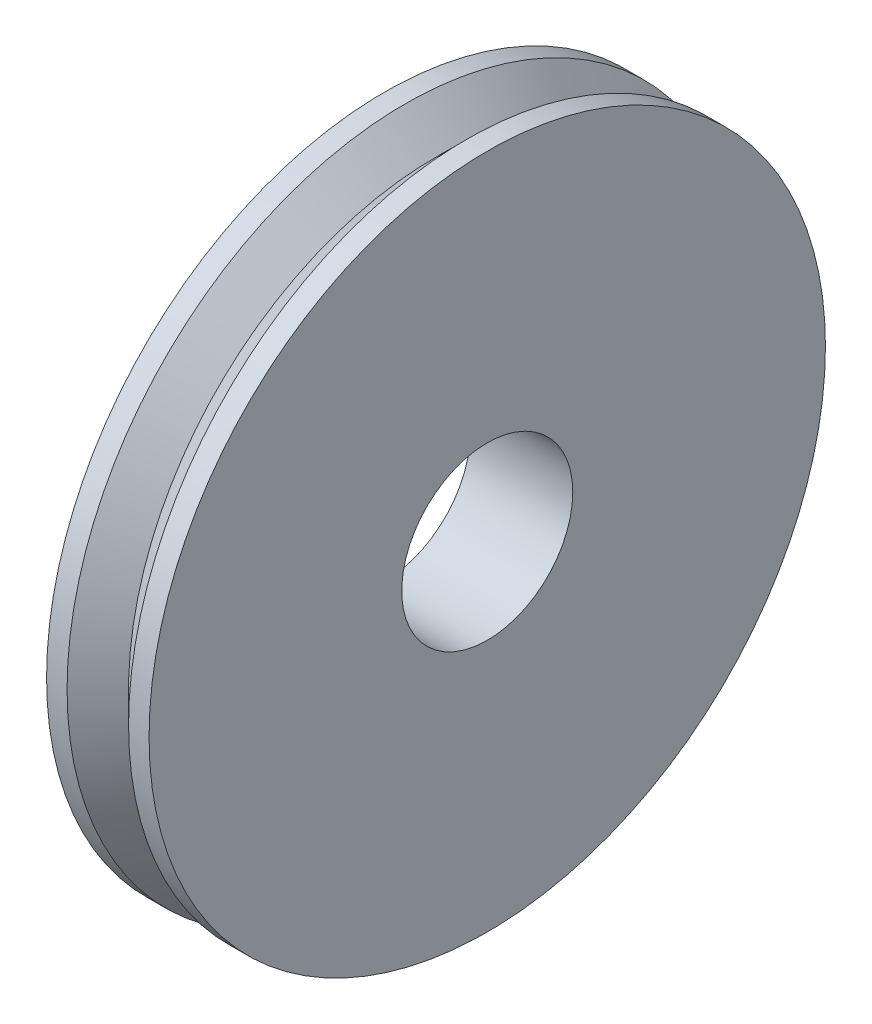
ISO-10303-21;
HEADER;
FILE_DESCRIPTION(('STEP AP214'),'2;1');
FILE_NAME('part.step','',(''),(''),'','','');
FILE_SCHEMA(('AUTOMOTIVE_DESIGN { 1 0 10303 214 1 1 1 1 }'));
ENDSEC;
DATA;
#1=APPLICATION_CONTEXT('core data for automotive mechanical design processes');
#2=APPLICATION_PROTOCOL_DEFINITION('international standard','automotive_design',2000,#1);
#3=PRODUCT_CONTEXT('',#1,'mechanical');
#4=PRODUCT('Part','Part','',(#3));
#5=PRODUCT_RELATED_PRODUCT_CATEGORY('part','',(#4));
#6=PRODUCT_DEFINITION_FORMATION('','',#4);
#7=PRODUCT_DEFINITION_CONTEXT('part definition',#1,'design');
#8=PRODUCT_DEFINITION('design','',#6,#7);
#9=PRODUCT_DEFINITION_SHAPE('','',#8);
#10=(LENGTH_UNIT() NAMED_UNIT(*) SI_UNIT(.MILLI.,.METRE.));
#11=(NAMED_UNIT(*) PLANE_ANGLE_UNIT() SI_UNIT($,.RADIAN.));
#12=(NAMED_UNIT(*) SI_UNIT($,.STERADIAN.) SOLID_ANGLE_UNIT());
#13=UNCERTAINTY_MEASURE_WITH_UNIT(LENGTH_MEASURE(1.E-05),#10,'distance_accuracy_value','');
#14=(GEOMETRIC_REPRESENTATION_CONTEXT(3) GLOBAL_UNCERTAINTY_ASSIGNED_CONTEXT((#13)) GLOBAL_UNIT_ASSIGNED_CONTEXT((#10,
#11,#12)) REPRESENTATION_CONTEXT('',''));
#15=CARTESIAN_POINT('',(0.,0.,0.));
#16=DIRECTION('',(0.,0.,1.));
#17=DIRECTION('',(1.,0.,0.));
#18=AXIS2_PLACEMENT_3D('',#15,#16,#17);
#19=CARTESIAN_POINT('',(35.1907458847143,70.7911725350088,-136.328078847471));
#20=DIRECTION('',(-1.,0.,0.));
#21=DIRECTION('',(0.,0.,1.));
#22=AXIS2_PLACEMENT_3D('',#19,#20,#21);
#23=PLANE('',#22);
#24=CARTESIAN_POINT('',(35.1907458847143,49.8361725350088,-136.328078847471));
#25=DIRECTION('',(1.,0.,0.));
#26=DIRECTION('',(0.,0.,-1.));
#27=AXIS2_PLACEMENT_3D('',#24,#25,#26);
#28=CIRCLE('',#27,5.3);
#29=CARTESIAN_POINT('',(35.1907458847143,49.8361725350088,-141.628078847471));
#30=VERTEX_POINT('',#29);
#31=EDGE_CURVE('E55',#30,#30,#28,.T.);
#32=ORIENTED_EDGE('',*,*,#31,.F.);
#33=EDGE_LOOP('',(#32));
#34=FACE_BOUND('',#33,.T.);
#35=CARTESIAN_POINT('',(35.1907458847143,49.8361725350088,-136.328078847471));
#36=DIRECTION('',(1.,0.,0.));
#37=DIRECTION('',(0.,0.,-1.));
#38=AXIS2_PLACEMENT_3D('',#35,#36,#37);
#39=CIRCLE('',#38,20.955);
#40=CARTESIAN_POINT('',(35.1907458847143,49.8361725350088,-157.283078847471));
#41=VERTEX_POINT('',#40);
#42=EDGE_CURVE('E10',#41,#41,#39,.T.);
#43=ORIENTED_EDGE('',*,*,#42,.T.);
#44=EDGE_LOOP('',(#43));
#45=FACE_BOUND('',#44,.T.);
#46=ADVANCED_FACE('F32',(#34,#45),#23,.F.);
#47=CARTESIAN_POINT('',(33.9207458847142,49.8361725350088,-136.328078847471));
#48=DIRECTION('',(1.,0.,0.));
#49=DIRECTION('',(0.,0.,-1.));
#50=AXIS2_PLACEMENT_3D('',#47,#48,#49);
#51=CYLINDRICAL_SURFACE('',#50,20.955);
#52=ORIENTED_EDGE('',*,*,#42,.F.);
#53=EDGE_LOOP('',(#52));
#54=FACE_BOUND('',#53,.T.);
#55=CARTESIAN_POINT('',(33.9207458847143,49.8361725350088,-136.328078847471));
#56=DIRECTION('',(1.,0.,0.));
#57=DIRECTION('',(0.,0.,-1.));
#58=AXIS2_PLACEMENT_3D('',#55,#56,#57);
#59=CIRCLE('',#58,20.955);
#60=CARTESIAN_POINT('',(33.9207458847143,49.8361725350088,-157.283078847471));
#61=VERTEX_POINT('',#60);
#62=EDGE_CURVE('E38',#61,#61,#59,.T.);
#63=ORIENTED_EDGE('',*,*,#62,.T.);
#64=EDGE_LOOP('',(#63));
#65=FACE_BOUND('',#64,.T.);
#66=ADVANCED_FACE('F72',(#54,#65),#51,.T.);
#67=CARTESIAN_POINT('',(32.0157458847143,49.8361725350088,-136.328078847471));
#68=DIRECTION('',(1.,0.,0.));
#69=DIRECTION('',(0.,0.,-1.));
#70=AXIS2_PLACEMENT_3D('',#67,#68,#69);
#71=CONICAL_SURFACE('',#70,19.05,0.78539816339745);
#72=ORIENTED_EDGE('',*,*,#62,.F.);
#73=EDGE_LOOP('',(#72));
#74=FACE_BOUND('',#73,.T.);
#75=CARTESIAN_POINT('',(32.0157458847143,49.8361725350088,-136.328078847471));
#76=DIRECTION('',(1.,0.,0.));
#77=DIRECTION('',(0.,0.,-1.));
#78=AXIS2_PLACEMENT_3D('',#75,#76,#77);
#79=CIRCLE('',#78,19.05);
#80=CARTESIAN_POINT('',(32.0157458847142,49.8361725350088,-155.378078847471));
#81=VERTEX_POINT('',#80);
#82=EDGE_CURVE('E51',#81,#81,#79,.T.);
#83=ORIENTED_EDGE('',*,*,#82,.T.);
#84=EDGE_LOOP('',(#83));
#85=FACE_BOUND('',#84,.T.);
#86=ADVANCED_FACE('F76',(#74,#85),#71,.T.);
#87=CARTESIAN_POINT('',(28.8407458847143,70.7911725350088,-136.328078847471));
#88=DIRECTION('',(1.,0.,0.));
#89=DIRECTION('',(0.,0.,1.));
#90=AXIS2_PLACEMENT_3D('',#87,#88,#89);
#91=PLANE('',#90);
#92=CARTESIAN_POINT('',(28.8407458847142,49.8361725350088,-136.328078847471));
#93=DIRECTION('',(1.,0.,0.));
#94=DIRECTION('',(0.,0.,-1.));
#95=AXIS2_PLACEMENT_3D('',#92,#93,#94);
#96=CIRCLE('',#95,5.3);
#97=CARTESIAN_POINT('',(28.8407458847142,49.8361725350088,-141.628078847471));
#98=VERTEX_POINT('',#97);
#99=EDGE_CURVE('E54',#98,#98,#96,.T.);
#100=ORIENTED_EDGE('',*,*,#99,.T.);
#101=EDGE_LOOP('',(#100));
#102=FACE_BOUND('',#101,.T.);
#103=CARTESIAN_POINT('',(28.8407458847143,49.8361725350088,-136.328078847471));
#104=DIRECTION('',(1.,0.,0.));
#105=DIRECTION('',(0.,0.,-1.));
#106=AXIS2_PLACEMENT_3D('',#103,#104,#105);
#107=CIRCLE('',#106,20.955);
#108=CARTESIAN_POINT('',(28.8407458847142,49.8361725350088,-157.283078847471));
#109=VERTEX_POINT('',#108);
#110=EDGE_CURVE('E42',#109,#109,#107,.T.);
#111=ORIENTED_EDGE('',*,*,#110,.F.);
#112=EDGE_LOOP('',(#111));
#113=FACE_BOUND('',#112,.T.);
#114=ADVANCED_FACE('F61',(#102,#113),#91,.F.);
#115=CARTESIAN_POINT('',(30.1107458847144,49.8361725350088,-136.328078847471));
#116=DIRECTION('',(-1.,0.,0.));
#117=DIRECTION('',(0.,0.,-1.));
#118=AXIS2_PLACEMENT_3D('',#115,#116,#117);
#119=CYLINDRICAL_SURFACE('',#118,20.955);
#120=ORIENTED_EDGE('',*,*,#110,.T.);
#121=EDGE_LOOP('',(#120));
#122=FACE_BOUND('',#121,.T.);
#123=CARTESIAN_POINT('',(30.1107458847143,49.8361725350088,-136.328078847471));
#124=DIRECTION('',(1.,0.,0.));
#125=DIRECTION('',(0.,0.,-1.));
#126=AXIS2_PLACEMENT_3D('',#123,#124,#125);
#127=CIRCLE('',#126,20.955);
#128=CARTESIAN_POINT('',(30.1107458847142,49.8361725350088,-157.283078847471));
#129=VERTEX_POINT('',#128);
#130=EDGE_CURVE('E46',#129,#129,#127,.T.);
#131=ORIENTED_EDGE('',*,*,#130,.F.);
#132=EDGE_LOOP('',(#131));
#133=FACE_BOUND('',#132,.T.);
#134=ADVANCED_FACE('F86',(#122,#133),#119,.T.);
#135=CARTESIAN_POINT('',(32.0157458847143,49.8361725350088,-136.328078847471));
#136=DIRECTION('',(-1.,0.,0.));
#137=DIRECTION('',(0.,0.,-1.));
#138=AXIS2_PLACEMENT_3D('',#135,#136,#137);
#139=CONICAL_SURFACE('',#138,19.05,0.78539816339745);
#140=ORIENTED_EDGE('',*,*,#130,.T.);
#141=EDGE_LOOP('',(#140));
#142=FACE_BOUND('',#141,.T.);
#143=ORIENTED_EDGE('',*,*,#82,.F.);
#144=EDGE_LOOP('',(#143));
#145=FACE_BOUND('',#144,.T.);
#146=ADVANCED_FACE('F67',(#142,#145),#139,.T.);
#147=CARTESIAN_POINT('',(28.8407458847142,49.8361725350088,-136.328078847471));
#148=DIRECTION('',(1.,0.,0.));
#149=DIRECTION('',(0.,0.,-1.));
#150=AXIS2_PLACEMENT_3D('',#147,#148,#149);
#151=CYLINDRICAL_SURFACE('',#150,5.3);
#152=ORIENTED_EDGE('',*,*,#99,.F.);
#153=EDGE_LOOP('',(#152));
#154=FACE_BOUND('',#153,.T.);
#155=ORIENTED_EDGE('',*,*,#31,.T.);
#156=EDGE_LOOP('',(#155));
#157=FACE_BOUND('',#156,.T.);
#158=ADVANCED_FACE('F64',(#154,#157),#151,.F.);
#159=CLOSED_SHELL('',(#46,#66,#86,#114,#134,#146,#158));
#160=MANIFOLD_SOLID_BREP('B2',#159);
#161=ADVANCED_BREP_SHAPE_REPRESENTATION('',(#18,#160),#14);
#162=SHAPE_DEFINITION_REPRESENTATION(#9,#161);
ENDSEC;
END-ISO-10303-21;
